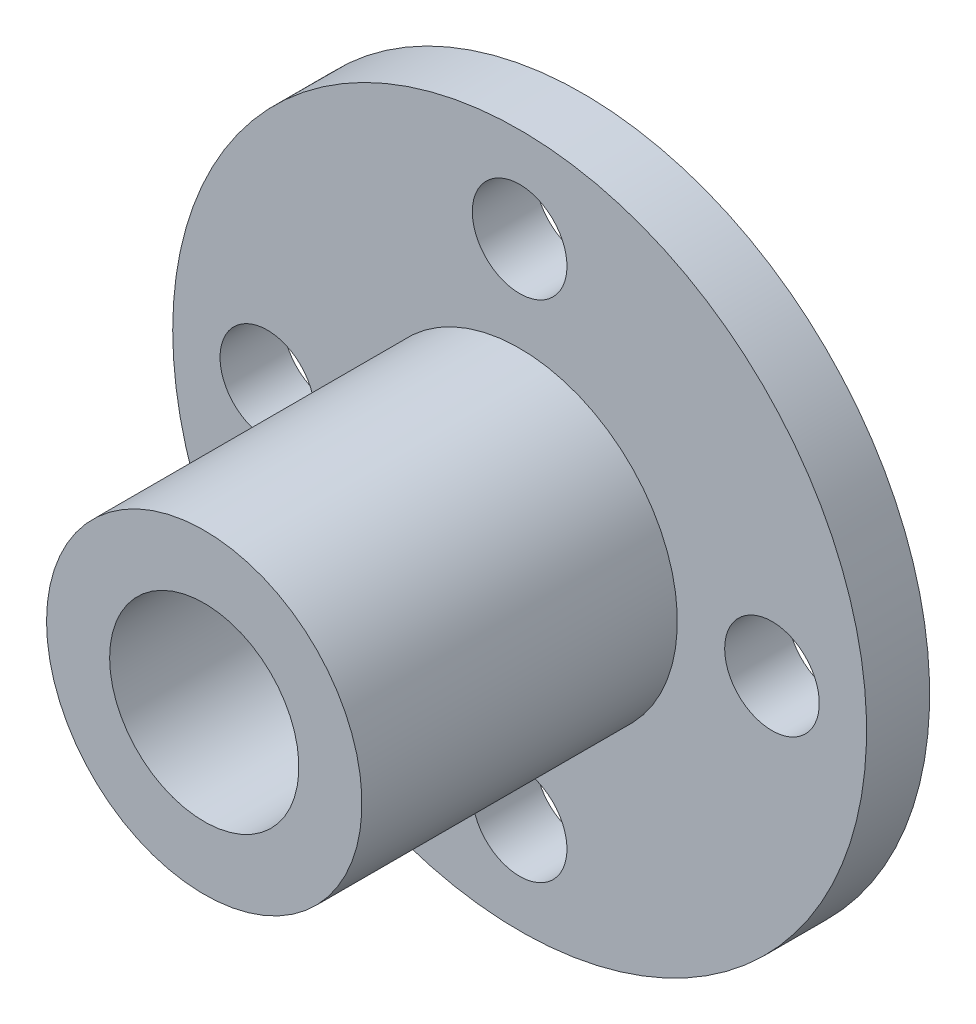
ISO-10303-21;
HEADER;
FILE_DESCRIPTION(('STEP AP214'),'2;1');
FILE_NAME('part.step','',(''),(''),'','','');
FILE_SCHEMA(('AUTOMOTIVE_DESIGN { 1 0 10303 214 1 1 1 1 }'));
ENDSEC;
DATA;
#1=APPLICATION_CONTEXT('core data for automotive mechanical design processes');
#2=APPLICATION_PROTOCOL_DEFINITION('international standard','automotive_design',2000,#1);
#3=PRODUCT_CONTEXT('',#1,'mechanical');
#4=PRODUCT('Part','Part','',(#3));
#5=PRODUCT_RELATED_PRODUCT_CATEGORY('part','',(#4));
#6=PRODUCT_DEFINITION_FORMATION('','',#4);
#7=PRODUCT_DEFINITION_CONTEXT('part definition',#1,'design');
#8=PRODUCT_DEFINITION('design','',#6,#7);
#9=PRODUCT_DEFINITION_SHAPE('','',#8);
#10=(LENGTH_UNIT() NAMED_UNIT(*) SI_UNIT(.MILLI.,.METRE.));
#11=(NAMED_UNIT(*) PLANE_ANGLE_UNIT() SI_UNIT($,.RADIAN.));
#12=(NAMED_UNIT(*) SI_UNIT($,.STERADIAN.) SOLID_ANGLE_UNIT());
#13=UNCERTAINTY_MEASURE_WITH_UNIT(LENGTH_MEASURE(1.E-05),#10,'distance_accuracy_value','');
#14=(GEOMETRIC_REPRESENTATION_CONTEXT(3) GLOBAL_UNCERTAINTY_ASSIGNED_CONTEXT((#13)) GLOBAL_UNIT_ASSIGNED_CONTEXT((#10,
#11,#12)) REPRESENTATION_CONTEXT('',''));
#15=CARTESIAN_POINT('',(0.,0.,0.));
#16=DIRECTION('',(0.,0.,1.));
#17=DIRECTION('',(1.,0.,0.));
#18=AXIS2_PLACEMENT_3D('',#15,#16,#17);
#19=CARTESIAN_POINT('',(0.,0.,0.));
#20=DIRECTION('',(0.,0.,-1.));
#21=DIRECTION('',(-1.,0.,0.));
#22=AXIS2_PLACEMENT_3D('',#19,#20,#21);
#23=PLANE('',#22);
#24=CARTESIAN_POINT('',(0.,0.,0.));
#25=DIRECTION('',(0.,0.,-1.));
#26=DIRECTION('',(-1.,0.,0.));
#27=AXIS2_PLACEMENT_3D('',#24,#25,#26);
#28=CIRCLE('',#27,3.);
#29=CARTESIAN_POINT('',(-3.,0.,0.));
#30=VERTEX_POINT('',#29);
#31=EDGE_CURVE('E64',#30,#30,#28,.T.);
#32=ORIENTED_EDGE('',*,*,#31,.T.);
#33=EDGE_LOOP('',(#32));
#34=FACE_BOUND('',#33,.T.);
#35=CARTESIAN_POINT('',(0.,0.,0.));
#36=DIRECTION('',(0.,0.,-1.));
#37=DIRECTION('',(-1.,0.,0.));
#38=AXIS2_PLACEMENT_3D('',#35,#36,#37);
#39=CIRCLE('',#38,5.);
#40=CARTESIAN_POINT('',(-5.,0.,0.));
#41=VERTEX_POINT('',#40);
#42=EDGE_CURVE('E10',#41,#41,#39,.T.);
#43=ORIENTED_EDGE('',*,*,#42,.F.);
#44=EDGE_LOOP('',(#43));
#45=FACE_BOUND('',#44,.T.);
#46=ADVANCED_FACE('F33',(#34,#45),#23,.F.);
#47=CARTESIAN_POINT('',(0.,0.,-12.));
#48=DIRECTION('',(0.,0.,-1.));
#49=DIRECTION('',(-1.,0.,0.));
#50=AXIS2_PLACEMENT_3D('',#47,#48,#49);
#51=CYLINDRICAL_SURFACE('',#50,5.);
#52=CARTESIAN_POINT('',(0.,0.,-10.));
#53=DIRECTION('',(0.,0.,-1.));
#54=DIRECTION('',(-1.,0.,0.));
#55=AXIS2_PLACEMENT_3D('',#52,#53,#54);
#56=CIRCLE('',#55,5.);
#57=CARTESIAN_POINT('',(-5.,0.,-10.));
#58=VERTEX_POINT('',#57);
#59=EDGE_CURVE('E39',#58,#58,#56,.T.);
#60=ORIENTED_EDGE('',*,*,#59,.F.);
#61=EDGE_LOOP('',(#60));
#62=FACE_BOUND('',#61,.T.);
#63=ORIENTED_EDGE('',*,*,#42,.T.);
#64=EDGE_LOOP('',(#63));
#65=FACE_BOUND('',#64,.T.);
#66=ADVANCED_FACE('F106',(#62,#65),#51,.T.);
#67=CARTESIAN_POINT('',(5.,0.,-10.));
#68=DIRECTION('',(0.,0.,-1.));
#69=DIRECTION('',(-1.,0.,0.));
#70=AXIS2_PLACEMENT_3D('',#67,#68,#69);
#71=PLANE('',#70);
#72=CARTESIAN_POINT('',(-8.,0.,-10.));
#73=DIRECTION('',(0.,0.,-1.));
#74=DIRECTION('',(-1.,0.,0.));
#75=AXIS2_PLACEMENT_3D('',#72,#73,#74);
#76=CIRCLE('',#75,1.5);
#77=CARTESIAN_POINT('',(-9.5,0.,-10.));
#78=VERTEX_POINT('',#77);
#79=EDGE_CURVE('E52',#78,#78,#76,.T.);
#80=ORIENTED_EDGE('',*,*,#79,.T.);
#81=EDGE_LOOP('',(#80));
#82=FACE_BOUND('',#81,.T.);
#83=CARTESIAN_POINT('',(0.,-8.,-10.));
#84=DIRECTION('',(0.,0.,-1.));
#85=DIRECTION('',(-1.,0.,0.));
#86=AXIS2_PLACEMENT_3D('',#83,#84,#85);
#87=CIRCLE('',#86,1.5);
#88=CARTESIAN_POINT('',(-1.5,-8.,-10.));
#89=VERTEX_POINT('',#88);
#90=EDGE_CURVE('E55',#89,#89,#87,.T.);
#91=ORIENTED_EDGE('',*,*,#90,.T.);
#92=EDGE_LOOP('',(#91));
#93=FACE_BOUND('',#92,.T.);
#94=CARTESIAN_POINT('',(8.,0.,-10.));
#95=DIRECTION('',(0.,0.,-1.));
#96=DIRECTION('',(-1.,0.,0.));
#97=AXIS2_PLACEMENT_3D('',#94,#95,#96);
#98=CIRCLE('',#97,1.5);
#99=CARTESIAN_POINT('',(6.5,0.,-10.));
#100=VERTEX_POINT('',#99);
#101=EDGE_CURVE('E58',#100,#100,#98,.T.);
#102=ORIENTED_EDGE('',*,*,#101,.T.);
#103=EDGE_LOOP('',(#102));
#104=FACE_BOUND('',#103,.T.);
#105=CARTESIAN_POINT('',(0.,8.,-10.));
#106=DIRECTION('',(0.,0.,-1.));
#107=DIRECTION('',(-1.,0.,0.));
#108=AXIS2_PLACEMENT_3D('',#105,#106,#107);
#109=CIRCLE('',#108,1.5);
#110=CARTESIAN_POINT('',(-1.5,8.,-10.));
#111=VERTEX_POINT('',#110);
#112=EDGE_CURVE('E61',#111,#111,#109,.T.);
#113=ORIENTED_EDGE('',*,*,#112,.T.);
#114=EDGE_LOOP('',(#113));
#115=FACE_BOUND('',#114,.T.);
#116=CARTESIAN_POINT('',(0.,0.,-10.));
#117=DIRECTION('',(0.,0.,-1.));
#118=DIRECTION('',(-1.,0.,0.));
#119=AXIS2_PLACEMENT_3D('',#116,#117,#118);
#120=CIRCLE('',#119,11.);
#121=CARTESIAN_POINT('',(-11.,0.,-10.));
#122=VERTEX_POINT('',#121);
#123=EDGE_CURVE('E43',#122,#122,#120,.T.);
#124=ORIENTED_EDGE('',*,*,#123,.F.);
#125=EDGE_LOOP('',(#124));
#126=FACE_BOUND('',#125,.T.);
#127=ORIENTED_EDGE('',*,*,#59,.T.);
#128=EDGE_LOOP('',(#127));
#129=FACE_BOUND('',#128,.T.);
#130=ADVANCED_FACE('F101',(#82,#93,#104,#115,#126,#129),#71,.F.);
#131=CARTESIAN_POINT('',(0.,0.,-12.));
#132=DIRECTION('',(0.,0.,-1.));
#133=DIRECTION('',(-1.,0.,0.));
#134=AXIS2_PLACEMENT_3D('',#131,#132,#133);
#135=CYLINDRICAL_SURFACE('',#134,11.);
#136=CARTESIAN_POINT('',(0.,0.,-12.));
#137=DIRECTION('',(0.,0.,-1.));
#138=DIRECTION('',(-1.,0.,0.));
#139=AXIS2_PLACEMENT_3D('',#136,#137,#138);
#140=CIRCLE('',#139,11.);
#141=CARTESIAN_POINT('',(-11.,0.,-12.));
#142=VERTEX_POINT('',#141);
#143=EDGE_CURVE('E47',#142,#142,#140,.T.);
#144=ORIENTED_EDGE('',*,*,#143,.F.);
#145=EDGE_LOOP('',(#144));
#146=FACE_BOUND('',#145,.T.);
#147=ORIENTED_EDGE('',*,*,#123,.T.);
#148=EDGE_LOOP('',(#147));
#149=FACE_BOUND('',#148,.T.);
#150=ADVANCED_FACE('F90',(#146,#149),#135,.T.);
#151=CARTESIAN_POINT('',(11.,0.,-12.));
#152=DIRECTION('',(0.,0.,1.));
#153=DIRECTION('',(1.,0.,0.));
#154=AXIS2_PLACEMENT_3D('',#151,#152,#153);
#155=PLANE('',#154);
#156=CARTESIAN_POINT('',(-8.,0.,-12.));
#157=DIRECTION('',(0.,0.,-1.));
#158=DIRECTION('',(-1.,0.,0.));
#159=AXIS2_PLACEMENT_3D('',#156,#157,#158);
#160=CIRCLE('',#159,1.5);
#161=CARTESIAN_POINT('',(-9.5,0.,-12.));
#162=VERTEX_POINT('',#161);
#163=EDGE_CURVE('E70',#162,#162,#160,.T.);
#164=ORIENTED_EDGE('',*,*,#163,.F.);
#165=EDGE_LOOP('',(#164));
#166=FACE_BOUND('',#165,.T.);
#167=CARTESIAN_POINT('',(0.,-8.,-12.));
#168=DIRECTION('',(0.,0.,-1.));
#169=DIRECTION('',(-1.,0.,0.));
#170=AXIS2_PLACEMENT_3D('',#167,#168,#169);
#171=CIRCLE('',#170,1.5);
#172=CARTESIAN_POINT('',(-1.5,-8.,-12.));
#173=VERTEX_POINT('',#172);
#174=EDGE_CURVE('E71',#173,#173,#171,.T.);
#175=ORIENTED_EDGE('',*,*,#174,.F.);
#176=EDGE_LOOP('',(#175));
#177=FACE_BOUND('',#176,.T.);
#178=CARTESIAN_POINT('',(8.,0.,-12.));
#179=DIRECTION('',(0.,0.,-1.));
#180=DIRECTION('',(-1.,0.,0.));
#181=AXIS2_PLACEMENT_3D('',#178,#179,#180);
#182=CIRCLE('',#181,1.5);
#183=CARTESIAN_POINT('',(6.5,0.,-12.));
#184=VERTEX_POINT('',#183);
#185=EDGE_CURVE('E74',#184,#184,#182,.T.);
#186=ORIENTED_EDGE('',*,*,#185,.F.);
#187=EDGE_LOOP('',(#186));
#188=FACE_BOUND('',#187,.T.);
#189=CARTESIAN_POINT('',(0.,8.,-12.));
#190=DIRECTION('',(0.,0.,-1.));
#191=DIRECTION('',(-1.,0.,0.));
#192=AXIS2_PLACEMENT_3D('',#189,#190,#191);
#193=CIRCLE('',#192,1.5);
#194=CARTESIAN_POINT('',(-1.5,8.,-12.));
#195=VERTEX_POINT('',#194);
#196=EDGE_CURVE('E77',#195,#195,#193,.T.);
#197=ORIENTED_EDGE('',*,*,#196,.F.);
#198=EDGE_LOOP('',(#197));
#199=FACE_BOUND('',#198,.T.);
#200=CARTESIAN_POINT('',(0.,0.,-12.));
#201=DIRECTION('',(0.,0.,-1.));
#202=DIRECTION('',(-1.,0.,0.));
#203=AXIS2_PLACEMENT_3D('',#200,#201,#202);
#204=CIRCLE('',#203,3.);
#205=CARTESIAN_POINT('',(-3.,0.,-12.));
#206=VERTEX_POINT('',#205);
#207=EDGE_CURVE('E67',#206,#206,#204,.T.);
#208=ORIENTED_EDGE('',*,*,#207,.F.);
#209=EDGE_LOOP('',(#208));
#210=FACE_BOUND('',#209,.T.);
#211=ORIENTED_EDGE('',*,*,#143,.T.);
#212=EDGE_LOOP('',(#211));
#213=FACE_BOUND('',#212,.T.);
#214=ADVANCED_FACE('F86',(#166,#177,#188,#199,#210,#213),#155,.F.);
#215=CARTESIAN_POINT('',(0.,0.,13.));
#216=DIRECTION('',(0.,0.,-1.));
#217=DIRECTION('',(-1.,0.,0.));
#218=AXIS2_PLACEMENT_3D('',#215,#216,#217);
#219=CYLINDRICAL_SURFACE('',#218,3.);
#220=ORIENTED_EDGE('',*,*,#207,.T.);
#221=EDGE_LOOP('',(#220));
#222=FACE_BOUND('',#221,.T.);
#223=ORIENTED_EDGE('',*,*,#31,.F.);
#224=EDGE_LOOP('',(#223));
#225=FACE_BOUND('',#224,.T.);
#226=ADVANCED_FACE('F89',(#222,#225),#219,.F.);
#227=CARTESIAN_POINT('',(0.,8.,13.));
#228=DIRECTION('',(0.,0.,-1.));
#229=DIRECTION('',(-1.,0.,0.));
#230=AXIS2_PLACEMENT_3D('',#227,#228,#229);
#231=CYLINDRICAL_SURFACE('',#230,1.5);
#232=ORIENTED_EDGE('',*,*,#196,.T.);
#233=EDGE_LOOP('',(#232));
#234=FACE_BOUND('',#233,.T.);
#235=ORIENTED_EDGE('',*,*,#112,.F.);
#236=EDGE_LOOP('',(#235));
#237=FACE_BOUND('',#236,.T.);
#238=ADVANCED_FACE('F122',(#234,#237),#231,.F.);
#239=CARTESIAN_POINT('',(8.,0.,13.));
#240=DIRECTION('',(0.,0.,-1.));
#241=DIRECTION('',(-1.,0.,0.));
#242=AXIS2_PLACEMENT_3D('',#239,#240,#241);
#243=CYLINDRICAL_SURFACE('',#242,1.5);
#244=ORIENTED_EDGE('',*,*,#185,.T.);
#245=EDGE_LOOP('',(#244));
#246=FACE_BOUND('',#245,.T.);
#247=ORIENTED_EDGE('',*,*,#101,.F.);
#248=EDGE_LOOP('',(#247));
#249=FACE_BOUND('',#248,.T.);
#250=ADVANCED_FACE('F83',(#246,#249),#243,.F.);
#251=CARTESIAN_POINT('',(0.,-8.,13.));
#252=DIRECTION('',(0.,0.,-1.));
#253=DIRECTION('',(-1.,0.,0.));
#254=AXIS2_PLACEMENT_3D('',#251,#252,#253);
#255=CYLINDRICAL_SURFACE('',#254,1.5);
#256=ORIENTED_EDGE('',*,*,#174,.T.);
#257=EDGE_LOOP('',(#256));
#258=FACE_BOUND('',#257,.T.);
#259=ORIENTED_EDGE('',*,*,#90,.F.);
#260=EDGE_LOOP('',(#259));
#261=FACE_BOUND('',#260,.T.);
#262=ADVANCED_FACE('F131',(#258,#261),#255,.F.);
#263=CARTESIAN_POINT('',(-8.,0.,13.));
#264=DIRECTION('',(0.,0.,-1.));
#265=DIRECTION('',(-1.,0.,0.));
#266=AXIS2_PLACEMENT_3D('',#263,#264,#265);
#267=CYLINDRICAL_SURFACE('',#266,1.5);
#268=ORIENTED_EDGE('',*,*,#163,.T.);
#269=EDGE_LOOP('',(#268));
#270=FACE_BOUND('',#269,.T.);
#271=ORIENTED_EDGE('',*,*,#79,.F.);
#272=EDGE_LOOP('',(#271));
#273=FACE_BOUND('',#272,.T.);
#274=ADVANCED_FACE('F134',(#270,#273),#267,.F.);
#275=CLOSED_SHELL('',(#46,#66,#130,#150,#214,#226,#238,#250,#262,#274));
#276=MANIFOLD_SOLID_BREP('B2',#275);
#277=ADVANCED_BREP_SHAPE_REPRESENTATION('',(#18,#276),#14);
#278=SHAPE_DEFINITION_REPRESENTATION(#9,#277);
ENDSEC;
END-ISO-10303-21;
